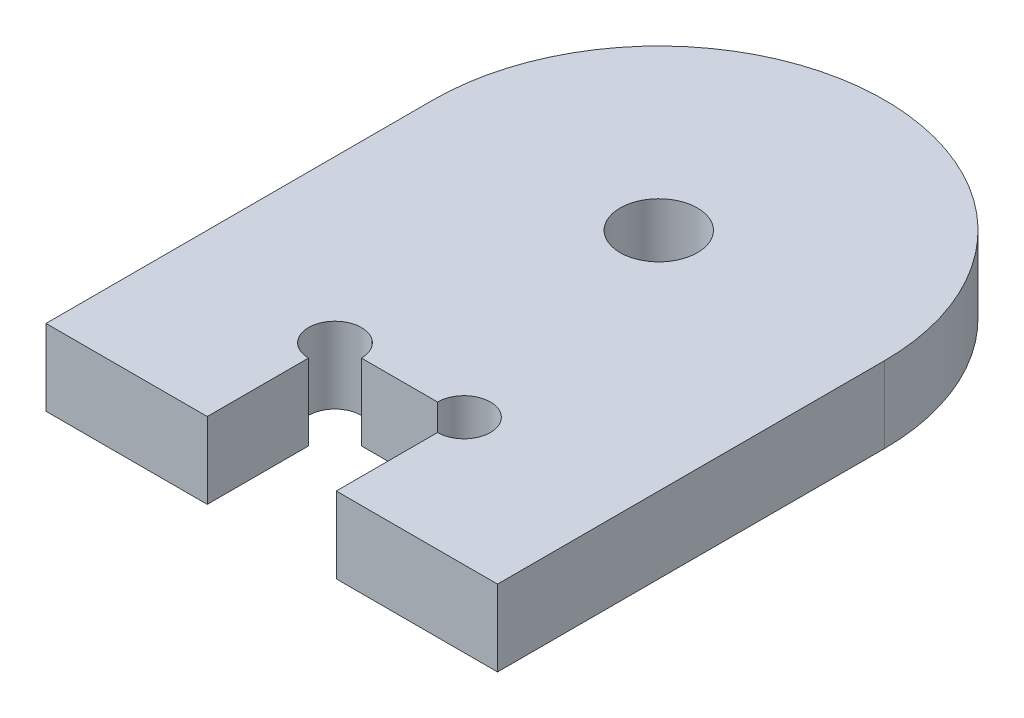
ISO-10303-21;
HEADER;
FILE_DESCRIPTION(('STEP AP214'),'2;1');
FILE_NAME('part.step','',(''),(''),'','','');
FILE_SCHEMA(('AUTOMOTIVE_DESIGN { 1 0 10303 214 1 1 1 1 }'));
ENDSEC;
DATA;
#1=APPLICATION_CONTEXT('core data for automotive mechanical design processes');
#2=APPLICATION_PROTOCOL_DEFINITION('international standard','automotive_design',2000,#1);
#3=PRODUCT_CONTEXT('',#1,'mechanical');
#4=PRODUCT('Part','Part','',(#3));
#5=PRODUCT_RELATED_PRODUCT_CATEGORY('part','',(#4));
#6=PRODUCT_DEFINITION_FORMATION('','',#4);
#7=PRODUCT_DEFINITION_CONTEXT('part definition',#1,'design');
#8=PRODUCT_DEFINITION('design','',#6,#7);
#9=PRODUCT_DEFINITION_SHAPE('','',#8);
#10=(LENGTH_UNIT() NAMED_UNIT(*) SI_UNIT(.MILLI.,.METRE.));
#11=(NAMED_UNIT(*) PLANE_ANGLE_UNIT() SI_UNIT($,.RADIAN.));
#12=(NAMED_UNIT(*) SI_UNIT($,.STERADIAN.) SOLID_ANGLE_UNIT());
#13=UNCERTAINTY_MEASURE_WITH_UNIT(LENGTH_MEASURE(1.E-05),#10,'distance_accuracy_value','');
#14=(GEOMETRIC_REPRESENTATION_CONTEXT(3) GLOBAL_UNCERTAINTY_ASSIGNED_CONTEXT((#13)) GLOBAL_UNIT_ASSIGNED_CONTEXT((#10,
#11,#12)) REPRESENTATION_CONTEXT('',''));
#15=CARTESIAN_POINT('',(0.,0.,0.));
#16=DIRECTION('',(0.,0.,1.));
#17=DIRECTION('',(1.,0.,0.));
#18=AXIS2_PLACEMENT_3D('',#15,#16,#17);
#19=CARTESIAN_POINT('',(0.,5.9,-12.5));
#20=DIRECTION('',(0.,-0.999999999999995,0.));
#21=DIRECTION('',(0.,0.,-1.00000000000001));
#22=AXIS2_PLACEMENT_3D('',#19,#20,#21);
#23=CYLINDRICAL_SURFACE('',#22,17.5);
#24=CARTESIAN_POINT('',(0.,6.38378239159465E-13,-12.5000000000002));
#25=DIRECTION('',(0.,0.999999999999995,0.));
#26=DIRECTION('',(0.,0.,1.00000000000001));
#27=AXIS2_PLACEMENT_3D('',#24,#25,#26);
#28=CIRCLE('',#27,17.5);
#29=CARTESIAN_POINT('',(17.4999999999994,6.38378239159465E-13,-12.5000000000002));
#30=VERTEX_POINT('',#29);
#31=CARTESIAN_POINT('',(-17.5,6.38378239159465E-13,-12.5));
#32=VERTEX_POINT('',#31);
#33=EDGE_CURVE('E139',#30,#32,#28,.T.);
#34=ORIENTED_EDGE('',*,*,#33,.T.);
#35=DIRECTION('',(0.,-0.999999999999995,0.));
#36=VECTOR('',#35,1.);
#37=CARTESIAN_POINT('',(-17.5,5.9,-12.5));
#38=LINE('',#37,#36);
#39=CARTESIAN_POINT('',(-17.5,5.9,-12.5));
#40=VERTEX_POINT('',#39);
#41=EDGE_CURVE('E11',#40,#32,#38,.T.);
#42=ORIENTED_EDGE('',*,*,#41,.F.);
#43=CARTESIAN_POINT('',(0.,5.9,-12.5));
#44=DIRECTION('',(0.,0.999999999999995,0.));
#45=DIRECTION('',(0.,0.,1.00000000000001));
#46=AXIS2_PLACEMENT_3D('',#43,#44,#45);
#47=CIRCLE('',#46,17.5);
#48=CARTESIAN_POINT('',(17.4999999999994,5.90000000000057,-12.5000000000002));
#49=VERTEX_POINT('',#48);
#50=EDGE_CURVE('E145',#49,#40,#47,.T.);
#51=ORIENTED_EDGE('',*,*,#50,.F.);
#52=DIRECTION('',(0.,-0.999999999999995,0.));
#53=VECTOR('',#52,1.);
#54=CARTESIAN_POINT('',(17.4999999999994,5.90000000000057,-12.5000000000002));
#55=LINE('',#54,#53);
#56=EDGE_CURVE('E45',#49,#30,#55,.T.);
#57=ORIENTED_EDGE('',*,*,#56,.T.);
#58=EDGE_LOOP('',(#34,#42,#51,#57));
#59=FACE_BOUND('',#58,.T.);
#60=ADVANCED_FACE('F38',(#59),#23,.T.);
#61=CARTESIAN_POINT('',(-17.4999999999999,5.89999999999959,6.38378239159465E-13));
#62=DIRECTION('',(0.999999999999985,0.,0.));
#63=DIRECTION('',(0.,0.,-1.00000000000001));
#64=AXIS2_PLACEMENT_3D('',#61,#62,#63);
#65=PLANE('',#64);
#66=DIRECTION('',(0.,0.,1.00000000000001));
#67=VECTOR('',#66,1.);
#68=CARTESIAN_POINT('',(-17.5,0.,0.));
#69=LINE('',#68,#67);
#70=CARTESIAN_POINT('',(-17.5,0.,17.5));
#71=VERTEX_POINT('',#70);
#72=EDGE_CURVE('E158',#32,#71,#69,.T.);
#73=ORIENTED_EDGE('',*,*,#72,.T.);
#74=DIRECTION('',(0.,-0.999999999999995,0.));
#75=VECTOR('',#74,1.);
#76=CARTESIAN_POINT('',(-17.5,5.9,17.5));
#77=LINE('',#76,#75);
#78=CARTESIAN_POINT('',(-17.5,5.9,17.5));
#79=VERTEX_POINT('',#78);
#80=EDGE_CURVE('E184',#79,#71,#77,.T.);
#81=ORIENTED_EDGE('',*,*,#80,.F.);
#82=DIRECTION('',(0.,0.,1.00000000000001));
#83=VECTOR('',#82,1.);
#84=CARTESIAN_POINT('',(-17.4999999999999,5.89999999999959,6.38378239159465E-13));
#85=LINE('',#84,#83);
#86=EDGE_CURVE('E148',#40,#79,#85,.T.);
#87=ORIENTED_EDGE('',*,*,#86,.F.);
#88=ORIENTED_EDGE('',*,*,#41,.T.);
#89=EDGE_LOOP('',(#73,#81,#87,#88));
#90=FACE_BOUND('',#89,.T.);
#91=ADVANCED_FACE('F236',(#90),#65,.F.);
#92=CARTESIAN_POINT('',(17.4999999999994,5.90000000000063,-2.22044604925031E-13));
#93=DIRECTION('',(0.999999999999985,0.,0.));
#94=DIRECTION('',(0.,0.,-1.00000000000001));
#95=AXIS2_PLACEMENT_3D('',#92,#93,#94);
#96=PLANE('',#95);
#97=DIRECTION('',(0.,0.,1.00000000000001));
#98=VECTOR('',#97,1.);
#99=CARTESIAN_POINT('',(17.4999999999994,6.38378239159465E-13,0.));
#100=LINE('',#99,#98);
#101=CARTESIAN_POINT('',(17.5,0.,17.5));
#102=VERTEX_POINT('',#101);
#103=EDGE_CURVE('E160',#30,#102,#100,.T.);
#104=ORIENTED_EDGE('',*,*,#103,.F.);
#105=ORIENTED_EDGE('',*,*,#56,.F.);
#106=DIRECTION('',(0.,0.,1.00000000000001));
#107=VECTOR('',#106,1.);
#108=CARTESIAN_POINT('',(17.4999999999994,5.90000000000063,-2.22044604925031E-13));
#109=LINE('',#108,#107);
#110=CARTESIAN_POINT('',(17.4999999999999,5.89999999999979,17.5000000000007));
#111=VERTEX_POINT('',#110);
#112=EDGE_CURVE('E151',#49,#111,#109,.T.);
#113=ORIENTED_EDGE('',*,*,#112,.T.);
#114=DIRECTION('',(0.,0.999999999999995,0.));
#115=VECTOR('',#114,1.);
#116=CARTESIAN_POINT('',(17.5,0.,17.5));
#117=LINE('',#116,#115);
#118=EDGE_CURVE('E180',#102,#111,#117,.T.);
#119=ORIENTED_EDGE('',*,*,#118,.F.);
#120=EDGE_LOOP('',(#104,#105,#113,#119));
#121=FACE_BOUND('',#120,.T.);
#122=ADVANCED_FACE('F178',(#121),#96,.T.);
#123=CARTESIAN_POINT('',(0.,5.9,-12.5));
#124=DIRECTION('',(0.,-0.999999999999995,0.));
#125=DIRECTION('',(0.,0.,-1.00000000000001));
#126=AXIS2_PLACEMENT_3D('',#123,#124,#125);
#127=CYLINDRICAL_SURFACE('',#126,3.);
#128=CARTESIAN_POINT('',(0.,5.9,-12.5));
#129=DIRECTION('',(0.,0.999999999999995,0.));
#130=DIRECTION('',(0.,0.,1.00000000000001));
#131=AXIS2_PLACEMENT_3D('',#128,#129,#130);
#132=CIRCLE('',#131,3.);
#133=CARTESIAN_POINT('',(0.,5.9,-9.49999999999997));
#134=VERTEX_POINT('',#133);
#135=EDGE_CURVE('E153',#134,#134,#132,.T.);
#136=ORIENTED_EDGE('',*,*,#135,.T.);
#137=EDGE_LOOP('',(#136));
#138=FACE_BOUND('',#137,.T.);
#139=CARTESIAN_POINT('',(0.,6.38378239159465E-13,-12.5000000000002));
#140=DIRECTION('',(0.,0.999999999999995,0.));
#141=DIRECTION('',(0.,0.,1.00000000000001));
#142=AXIS2_PLACEMENT_3D('',#139,#140,#141);
#143=CIRCLE('',#142,3.);
#144=CARTESIAN_POINT('',(0.,6.39189984472286E-13,-9.5000000000002));
#145=VERTEX_POINT('',#144);
#146=EDGE_CURVE('E149',#145,#145,#143,.T.);
#147=ORIENTED_EDGE('',*,*,#146,.F.);
#148=EDGE_LOOP('',(#147));
#149=FACE_BOUND('',#148,.T.);
#150=ADVANCED_FACE('F244',(#138,#149),#127,.F.);
#151=CARTESIAN_POINT('',(0.,5.89999999999936,0.));
#152=DIRECTION('',(0.,0.999999999999995,0.));
#153=DIRECTION('',(0.,0.,1.00000000000001));
#154=AXIS2_PLACEMENT_3D('',#151,#152,#153);
#155=PLANE('',#154);
#156=CARTESIAN_POINT('',(-5.00000000000063,5.9000000000005,7.60000000000025));
#157=DIRECTION('',(0.,0.999999999999995,0.));
#158=DIRECTION('',(0.,0.,1.00000000000001));
#159=AXIS2_PLACEMENT_3D('',#156,#157,#158);
#160=CIRCLE('',#159,2.05);
#161=CARTESIAN_POINT('',(-2.94999999999999,5.9,7.60000000000001));
#162=VERTEX_POINT('',#161);
#163=CARTESIAN_POINT('',(-5.,5.90000000000064,9.65000000000001));
#164=VERTEX_POINT('',#163);
#165=EDGE_CURVE('E112',#162,#164,#160,.T.);
#166=ORIENTED_EDGE('',*,*,#165,.F.);
#167=DIRECTION('',(-0.999999999999985,0.,0.));
#168=VECTOR('',#167,1.);
#169=CARTESIAN_POINT('',(-5.00000000000063,5.9000000000005,7.60000000000025));
#170=LINE('',#169,#168);
#171=CARTESIAN_POINT('',(2.94999999999999,5.89999999999999,7.6));
#172=VERTEX_POINT('',#171);
#173=EDGE_CURVE('E136',#172,#162,#170,.T.);
#174=ORIENTED_EDGE('',*,*,#173,.F.);
#175=CARTESIAN_POINT('',(4.99999999999999,5.9,7.6));
#176=DIRECTION('',(0.,0.999999999999995,0.));
#177=DIRECTION('',(0.,0.,1.00000000000001));
#178=AXIS2_PLACEMENT_3D('',#175,#176,#177);
#179=CIRCLE('',#178,2.05);
#180=CARTESIAN_POINT('',(4.99999999999937,5.9,9.65000000000002));
#181=VERTEX_POINT('',#180);
#182=EDGE_CURVE('E52',#181,#172,#179,.T.);
#183=ORIENTED_EDGE('',*,*,#182,.F.);
#184=DIRECTION('',(0.,0.,-1.00000000000001));
#185=VECTOR('',#184,1.);
#186=CARTESIAN_POINT('',(4.99999999999999,5.90000000000064,19.4000000000001));
#187=LINE('',#186,#185);
#188=CARTESIAN_POINT('',(4.99999999999937,5.90000000000046,17.5000000000001));
#189=VERTEX_POINT('',#188);
#190=EDGE_CURVE('E141',#189,#181,#187,.T.);
#191=ORIENTED_EDGE('',*,*,#190,.F.);
#192=DIRECTION('',(-0.999999999999985,0.,0.));
#193=VECTOR('',#192,1.);
#194=CARTESIAN_POINT('',(17.4999999999999,5.89999999999979,17.5000000000007));
#195=LINE('',#194,#193);
#196=EDGE_CURVE('E185',#111,#189,#195,.T.);
#197=ORIENTED_EDGE('',*,*,#196,.F.);
#198=ORIENTED_EDGE('',*,*,#112,.F.);
#199=ORIENTED_EDGE('',*,*,#50,.T.);
#200=ORIENTED_EDGE('',*,*,#86,.T.);
#201=DIRECTION('',(-0.999999999999985,0.,0.));
#202=VECTOR('',#201,1.);
#203=CARTESIAN_POINT('',(-5.,5.9,17.5));
#204=LINE('',#203,#202);
#205=CARTESIAN_POINT('',(-5.,5.9,17.5));
#206=VERTEX_POINT('',#205);
#207=EDGE_CURVE('E134',#206,#79,#204,.T.);
#208=ORIENTED_EDGE('',*,*,#207,.F.);
#209=DIRECTION('',(0.,0.,1.00000000000001));
#210=VECTOR('',#209,1.);
#211=CARTESIAN_POINT('',(-4.99999999999999,5.9,19.4));
#212=LINE('',#211,#210);
#213=EDGE_CURVE('E126',#164,#206,#212,.T.);
#214=ORIENTED_EDGE('',*,*,#213,.F.);
#215=EDGE_LOOP('',(#166,#174,#183,#191,#197,#198,#199,#200,#208,#214));
#216=FACE_BOUND('',#215,.T.);
#217=ORIENTED_EDGE('',*,*,#135,.F.);
#218=EDGE_LOOP('',(#217));
#219=FACE_BOUND('',#218,.T.);
#220=ADVANCED_FACE('F131',(#216,#219),#155,.T.);
#221=CARTESIAN_POINT('',(0.,0.,0.));
#222=DIRECTION('',(0.,0.999999999999995,0.));
#223=DIRECTION('',(0.,0.,1.00000000000001));
#224=AXIS2_PLACEMENT_3D('',#221,#222,#223);
#225=PLANE('',#224);
#226=DIRECTION('',(0.999999999999985,0.,0.));
#227=VECTOR('',#226,1.);
#228=CARTESIAN_POINT('',(-5.00000000000053,6.38378239159465E-13,7.59999999999987));
#229=LINE('',#228,#227);
#230=CARTESIAN_POINT('',(-2.94999999999999,6.38378239159465E-13,7.60000000000001));
#231=VERTEX_POINT('',#230);
#232=CARTESIAN_POINT('',(2.94999999999999,0.,7.60000000000001));
#233=VERTEX_POINT('',#232);
#234=EDGE_CURVE('E135',#231,#233,#229,.T.);
#235=ORIENTED_EDGE('',*,*,#234,.F.);
#236=CARTESIAN_POINT('',(-5.00000000000053,6.38378239159465E-13,7.59999999999987));
#237=DIRECTION('',(0.,0.999999999999995,0.));
#238=DIRECTION('',(0.,0.,1.00000000000001));
#239=AXIS2_PLACEMENT_3D('',#236,#237,#238);
#240=CIRCLE('',#239,2.05);
#241=CARTESIAN_POINT('',(-5.,0.,9.65000000000002));
#242=VERTEX_POINT('',#241);
#243=EDGE_CURVE('E60',#242,#231,#240,.F.);
#244=ORIENTED_EDGE('',*,*,#243,.F.);
#245=DIRECTION('',(0.,0.,-1.00000000000001));
#246=VECTOR('',#245,1.);
#247=CARTESIAN_POINT('',(-4.99999999999999,6.38378239159465E-13,19.4));
#248=LINE('',#247,#246);
#249=CARTESIAN_POINT('',(-5.,0.,17.5));
#250=VERTEX_POINT('',#249);
#251=EDGE_CURVE('E128',#250,#242,#248,.T.);
#252=ORIENTED_EDGE('',*,*,#251,.F.);
#253=DIRECTION('',(0.999999999999985,0.,0.));
#254=VECTOR('',#253,1.);
#255=CARTESIAN_POINT('',(-17.5,0.,17.5));
#256=LINE('',#255,#254);
#257=EDGE_CURVE('E188',#71,#250,#256,.T.);
#258=ORIENTED_EDGE('',*,*,#257,.F.);
#259=ORIENTED_EDGE('',*,*,#72,.F.);
#260=ORIENTED_EDGE('',*,*,#33,.F.);
#261=ORIENTED_EDGE('',*,*,#103,.T.);
#262=DIRECTION('',(0.999999999999985,0.,0.));
#263=VECTOR('',#262,1.);
#264=CARTESIAN_POINT('',(4.99999999999938,3.05311331771918E-13,17.5000000000003));
#265=LINE('',#264,#263);
#266=CARTESIAN_POINT('',(4.99999999999938,3.05311331771918E-13,17.5000000000003));
#267=VERTEX_POINT('',#266);
#268=EDGE_CURVE('E210',#267,#102,#265,.T.);
#269=ORIENTED_EDGE('',*,*,#268,.F.);
#270=DIRECTION('',(0.,0.,1.00000000000001));
#271=VECTOR('',#270,1.);
#272=CARTESIAN_POINT('',(4.99999999999999,6.38378239159465E-13,19.4));
#273=LINE('',#272,#271);
#274=CARTESIAN_POINT('',(4.99999999999937,6.38378239159465E-13,9.65000000000001));
#275=VERTEX_POINT('',#274);
#276=EDGE_CURVE('E200',#275,#267,#273,.T.);
#277=ORIENTED_EDGE('',*,*,#276,.F.);
#278=CARTESIAN_POINT('',(4.99999999999999,6.38378239159465E-13,7.60000000000001));
#279=DIRECTION('',(0.,0.999999999999995,0.));
#280=DIRECTION('',(0.,0.,1.00000000000001));
#281=AXIS2_PLACEMENT_3D('',#278,#279,#280);
#282=CIRCLE('',#281,2.05);
#283=EDGE_CURVE('E219',#233,#275,#282,.F.);
#284=ORIENTED_EDGE('',*,*,#283,.F.);
#285=EDGE_LOOP('',(#235,#244,#252,#258,#259,#260,#261,#269,#277,#284));
#286=FACE_BOUND('',#285,.T.);
#287=ORIENTED_EDGE('',*,*,#146,.T.);
#288=EDGE_LOOP('',(#287));
#289=FACE_BOUND('',#288,.T.);
#290=ADVANCED_FACE('F172',(#286,#289),#225,.F.);
#291=CARTESIAN_POINT('',(4.99999999999991,-0.000999999999362622,19.4000000000004));
#292=DIRECTION('',(0.999999999999985,0.,0.));
#293=DIRECTION('',(0.,0.,-1.00000000000001));
#294=AXIS2_PLACEMENT_3D('',#291,#292,#293);
#295=PLANE('',#294);
#296=ORIENTED_EDGE('',*,*,#190,.T.);
#297=DIRECTION('',(0.,0.999999999999995,0.));
#298=VECTOR('',#297,1.);
#299=CARTESIAN_POINT('',(4.9999999999998,-0.000999999999529155,9.65000000000021));
#300=LINE('',#299,#298);
#301=EDGE_CURVE('E206',#275,#181,#300,.T.);
#302=ORIENTED_EDGE('',*,*,#301,.F.);
#303=ORIENTED_EDGE('',*,*,#276,.T.);
#304=DIRECTION('',(0.,-0.999999999999995,0.));
#305=VECTOR('',#304,1.);
#306=CARTESIAN_POINT('',(4.99999999999937,5.90000000000046,17.5000000000001));
#307=LINE('',#306,#305);
#308=EDGE_CURVE('E190',#189,#267,#307,.T.);
#309=ORIENTED_EDGE('',*,*,#308,.F.);
#310=EDGE_LOOP('',(#296,#302,#303,#309));
#311=FACE_BOUND('',#310,.T.);
#312=ADVANCED_FACE('F205',(#311),#295,.F.);
#313=CARTESIAN_POINT('',(-4.99999999999999,-0.000999999999543033,19.4000000000003));
#314=DIRECTION('',(-0.999999999999985,0.,0.));
#315=DIRECTION('',(0.,0.,1.00000000000001));
#316=AXIS2_PLACEMENT_3D('',#313,#314,#315);
#317=PLANE('',#316);
#318=ORIENTED_EDGE('',*,*,#251,.T.);
#319=DIRECTION('',(0.,0.999999999999995,0.));
#320=VECTOR('',#319,1.);
#321=CARTESIAN_POINT('',(-5.00000000000018,-0.000999999999570789,9.65000000000063));
#322=LINE('',#321,#320);
#323=EDGE_CURVE('E115',#164,#242,#322,.F.);
#324=ORIENTED_EDGE('',*,*,#323,.F.);
#325=ORIENTED_EDGE('',*,*,#213,.T.);
#326=DIRECTION('',(0.,0.999999999999995,0.));
#327=VECTOR('',#326,1.);
#328=CARTESIAN_POINT('',(-5.,0.,17.5));
#329=LINE('',#328,#327);
#330=EDGE_CURVE('E196',#250,#206,#329,.T.);
#331=ORIENTED_EDGE('',*,*,#330,.F.);
#332=EDGE_LOOP('',(#318,#324,#325,#331));
#333=FACE_BOUND('',#332,.T.);
#334=ADVANCED_FACE('F124',(#333),#317,.F.);
#335=CARTESIAN_POINT('',(-5.00000000000028,-0.000999999999654055,7.5999999999998));
#336=DIRECTION('',(0.,0.,-1.00000000000001));
#337=DIRECTION('',(-0.999999999999985,0.,0.));
#338=AXIS2_PLACEMENT_3D('',#335,#336,#337);
#339=PLANE('',#338);
#340=ORIENTED_EDGE('',*,*,#173,.T.);
#341=DIRECTION('',(0.,0.999999999999995,0.));
#342=VECTOR('',#341,1.);
#343=CARTESIAN_POINT('',(-2.94999999999984,-0.000999999999723444,7.60000000000063));
#344=LINE('',#343,#342);
#345=EDGE_CURVE('E116',#231,#162,#344,.T.);
#346=ORIENTED_EDGE('',*,*,#345,.F.);
#347=ORIENTED_EDGE('',*,*,#234,.T.);
#348=DIRECTION('',(0.,0.999999999999995,0.));
#349=VECTOR('',#348,1.);
#350=CARTESIAN_POINT('',(2.94999999999983,-0.001000000000001,7.59999999999937));
#351=LINE('',#350,#349);
#352=EDGE_CURVE('E215',#172,#233,#351,.F.);
#353=ORIENTED_EDGE('',*,*,#352,.F.);
#354=EDGE_LOOP('',(#340,#346,#347,#353));
#355=FACE_BOUND('',#354,.T.);
#356=ADVANCED_FACE('F223',(#355),#339,.F.);
#357=CARTESIAN_POINT('',(-2.91433543964104E-13,2.4980018054066E-13,17.5000000000007));
#358=DIRECTION('',(0.,0.,1.00000000000001));
#359=DIRECTION('',(0.999999999999985,0.,0.));
#360=AXIS2_PLACEMENT_3D('',#357,#358,#359);
#361=PLANE('',#360);
#362=ORIENTED_EDGE('',*,*,#80,.T.);
#363=ORIENTED_EDGE('',*,*,#257,.T.);
#364=ORIENTED_EDGE('',*,*,#330,.T.);
#365=ORIENTED_EDGE('',*,*,#207,.T.);
#366=EDGE_LOOP('',(#362,#363,#364,#365));
#367=FACE_BOUND('',#366,.T.);
#368=ADVANCED_FACE('F225',(#367),#361,.T.);
#369=CARTESIAN_POINT('',(-2.91433543964104E-13,2.4980018054066E-13,17.5000000000007));
#370=DIRECTION('',(0.,0.,1.00000000000001));
#371=DIRECTION('',(0.999999999999985,0.,0.));
#372=AXIS2_PLACEMENT_3D('',#369,#370,#371);
#373=PLANE('',#372);
#374=ORIENTED_EDGE('',*,*,#118,.T.);
#375=ORIENTED_EDGE('',*,*,#196,.T.);
#376=ORIENTED_EDGE('',*,*,#308,.T.);
#377=ORIENTED_EDGE('',*,*,#268,.T.);
#378=EDGE_LOOP('',(#374,#375,#376,#377));
#379=FACE_BOUND('',#378,.T.);
#380=ADVANCED_FACE('F209',(#379),#373,.T.);
#381=CARTESIAN_POINT('',(4.99999999999964,-0.000999999999640178,7.60000000000048));
#382=DIRECTION('',(0.,0.999999999999995,0.));
#383=DIRECTION('',(0.,0.,1.00000000000001));
#384=AXIS2_PLACEMENT_3D('',#381,#382,#383);
#385=CYLINDRICAL_SURFACE('',#384,2.05);
#386=ORIENTED_EDGE('',*,*,#301,.T.);
#387=ORIENTED_EDGE('',*,*,#182,.T.);
#388=ORIENTED_EDGE('',*,*,#352,.T.);
#389=ORIENTED_EDGE('',*,*,#283,.T.);
#390=EDGE_LOOP('',(#386,#387,#388,#389));
#391=FACE_BOUND('',#390,.T.);
#392=ADVANCED_FACE('F221',(#391),#385,.F.);
#393=CARTESIAN_POINT('',(-5.00000000000028,-0.000999999999654055,7.5999999999998));
#394=DIRECTION('',(0.,0.999999999999995,0.));
#395=DIRECTION('',(0.,0.,1.00000000000001));
#396=AXIS2_PLACEMENT_3D('',#393,#394,#395);
#397=CYLINDRICAL_SURFACE('',#396,2.05);
#398=ORIENTED_EDGE('',*,*,#323,.T.);
#399=ORIENTED_EDGE('',*,*,#243,.T.);
#400=ORIENTED_EDGE('',*,*,#345,.T.);
#401=ORIENTED_EDGE('',*,*,#165,.T.);
#402=EDGE_LOOP('',(#398,#399,#400,#401));
#403=FACE_BOUND('',#402,.T.);
#404=ADVANCED_FACE('F114',(#403),#397,.F.);
#405=CLOSED_SHELL('',(#60,#91,#122,#150,#220,#290,#312,#334,#356,#368,#380,#392,#404));
#406=MANIFOLD_SOLID_BREP('B2',#405);
#407=ADVANCED_BREP_SHAPE_REPRESENTATION('',(#18,#406),#14);
#408=SHAPE_DEFINITION_REPRESENTATION(#9,#407);
ENDSEC;
END-ISO-10303-21;
